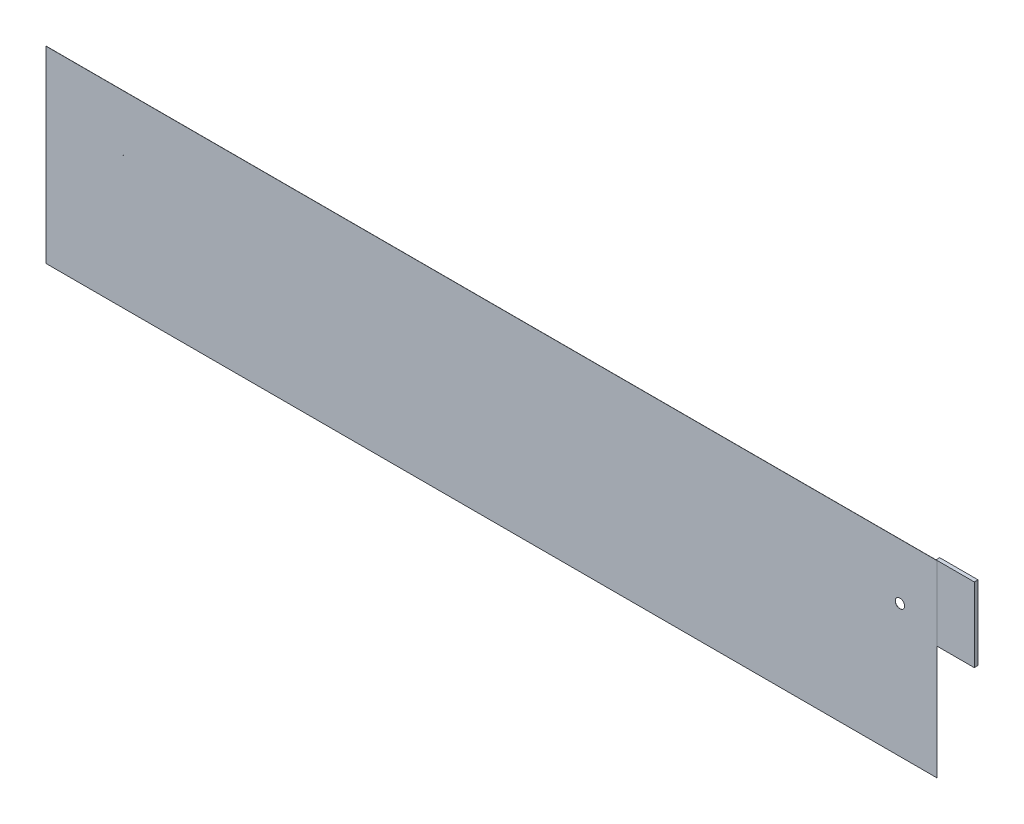
ISO-10303-21;
HEADER;
FILE_DESCRIPTION(('STEP AP214'),'2;1');
FILE_NAME('part.step','',(''),(''),'','','');
FILE_SCHEMA(('AUTOMOTIVE_DESIGN { 1 0 10303 214 1 1 1 1 }'));
ENDSEC;
DATA;
#1=APPLICATION_CONTEXT('core data for automotive mechanical design processes');
#2=APPLICATION_PROTOCOL_DEFINITION('international standard','automotive_design',2000,#1);
#3=PRODUCT_CONTEXT('',#1,'mechanical');
#4=PRODUCT('Part','Part','',(#3));
#5=PRODUCT_RELATED_PRODUCT_CATEGORY('part','',(#4));
#6=PRODUCT_DEFINITION_FORMATION('','',#4);
#7=PRODUCT_DEFINITION_CONTEXT('part definition',#1,'design');
#8=PRODUCT_DEFINITION('design','',#6,#7);
#9=PRODUCT_DEFINITION_SHAPE('','',#8);
#10=(LENGTH_UNIT() NAMED_UNIT(*) SI_UNIT(.MILLI.,.METRE.));
#11=(NAMED_UNIT(*) PLANE_ANGLE_UNIT() SI_UNIT($,.RADIAN.));
#12=(NAMED_UNIT(*) SI_UNIT($,.STERADIAN.) SOLID_ANGLE_UNIT());
#13=UNCERTAINTY_MEASURE_WITH_UNIT(LENGTH_MEASURE(1.E-05),#10,'distance_accuracy_value','');
#14=(GEOMETRIC_REPRESENTATION_CONTEXT(3) GLOBAL_UNCERTAINTY_ASSIGNED_CONTEXT((#13)) GLOBAL_UNIT_ASSIGNED_CONTEXT((#10,
#11,#12)) REPRESENTATION_CONTEXT('',''));
#15=CARTESIAN_POINT('',(0.,0.,0.));
#16=DIRECTION('',(0.,0.,1.));
#17=DIRECTION('',(1.,0.,0.));
#18=AXIS2_PLACEMENT_3D('',#15,#16,#17);
#19=CARTESIAN_POINT('',(0.,0.,0.));
#20=DIRECTION('',(0.,0.,-1.));
#21=DIRECTION('',(-1.,0.,0.));
#22=AXIS2_PLACEMENT_3D('',#19,#20,#21);
#23=PLANE('',#22);
#24=CARTESIAN_POINT('',(52.9746921364165,90.678,0.));
#25=DIRECTION('',(0.,0.,1.));
#26=DIRECTION('',(1.,0.,0.));
#27=AXIS2_PLACEMENT_3D('',#24,#25,#26);
#28=CIRCLE('',#27,0.174798991152219);
#29=CARTESIAN_POINT('',(53.1494911275687,90.678,0.));
#30=VERTEX_POINT('',#29);
#31=EDGE_CURVE('E157',#30,#30,#28,.T.);
#32=ORIENTED_EDGE('',*,*,#31,.T.);
#33=EDGE_LOOP('',(#32));
#34=FACE_BOUND('',#33,.T.);
#35=CARTESIAN_POINT('',(584.2,90.678,0.));
#36=DIRECTION('',(0.,0.,1.));
#37=DIRECTION('',(1.,0.,0.));
#38=AXIS2_PLACEMENT_3D('',#35,#36,#37);
#39=CIRCLE('',#38,3.17500000000008);
#40=CARTESIAN_POINT('',(587.375,90.678,0.));
#41=VERTEX_POINT('',#40);
#42=EDGE_CURVE('E144',#41,#41,#39,.T.);
#43=ORIENTED_EDGE('',*,*,#42,.T.);
#44=EDGE_LOOP('',(#43));
#45=FACE_BOUND('',#44,.T.);
#46=DIRECTION('',(-1.,0.,0.));
#47=VECTOR('',#46,1.);
#48=CARTESIAN_POINT('',(0.,128.778,0.));
#49=LINE('',#48,#47);
#50=CARTESIAN_POINT('',(608.80625,128.778,0.));
#51=VERTEX_POINT('',#50);
#52=CARTESIAN_POINT('',(0.,128.778,0.));
#53=VERTEX_POINT('',#52);
#54=EDGE_CURVE('E82',#51,#53,#49,.T.);
#55=ORIENTED_EDGE('',*,*,#54,.F.);
#56=DIRECTION('',(0.,-1.,0.));
#57=VECTOR('',#56,1.);
#58=CARTESIAN_POINT('',(608.80625,0.,0.));
#59=LINE('',#58,#57);
#60=CARTESIAN_POINT('',(608.80625,77.978,0.));
#61=VERTEX_POINT('',#60);
#62=EDGE_CURVE('E137',#51,#61,#59,.T.);
#63=ORIENTED_EDGE('',*,*,#62,.T.);
#64=DIRECTION('',(1.,0.,0.));
#65=VECTOR('',#64,1.);
#66=CARTESIAN_POINT('',(0.,77.978,0.));
#67=LINE('',#66,#65);
#68=CARTESIAN_POINT('',(609.6,77.978,0.));
#69=VERTEX_POINT('',#68);
#70=EDGE_CURVE('E207',#61,#69,#67,.T.);
#71=ORIENTED_EDGE('',*,*,#70,.T.);
#72=DIRECTION('',(0.,1.,0.));
#73=VECTOR('',#72,1.);
#74=CARTESIAN_POINT('',(609.6,0.,0.));
#75=LINE('',#74,#73);
#76=CARTESIAN_POINT('',(609.6,0.,0.));
#77=VERTEX_POINT('',#76);
#78=EDGE_CURVE('E185',#77,#69,#75,.T.);
#79=ORIENTED_EDGE('',*,*,#78,.F.);
#80=DIRECTION('',(1.,0.,0.));
#81=VECTOR('',#80,1.);
#82=CARTESIAN_POINT('',(0.,0.,0.));
#83=LINE('',#82,#81);
#84=CARTESIAN_POINT('',(0.,0.,0.));
#85=VERTEX_POINT('',#84);
#86=EDGE_CURVE('E181',#85,#77,#83,.T.);
#87=ORIENTED_EDGE('',*,*,#86,.F.);
#88=DIRECTION('',(0.,-1.,0.));
#89=VECTOR('',#88,1.);
#90=CARTESIAN_POINT('',(0.,0.,0.));
#91=LINE('',#90,#89);
#92=EDGE_CURVE('E163',#53,#85,#91,.T.);
#93=ORIENTED_EDGE('',*,*,#92,.F.);
#94=EDGE_LOOP('',(#55,#63,#71,#79,#87,#93));
#95=FACE_BOUND('',#94,.T.);
#96=ADVANCED_FACE('F39',(#34,#45,#95),#23,.T.);
#97=CARTESIAN_POINT('',(0.,0.,0.0999998));
#98=DIRECTION('',(0.,0.,-1.));
#99=DIRECTION('',(-1.,0.,0.));
#100=AXIS2_PLACEMENT_3D('',#97,#98,#99);
#101=PLANE('',#100);
#102=DIRECTION('',(0.,-1.,0.));
#103=VECTOR('',#102,1.);
#104=CARTESIAN_POINT('',(0.,0.,0.0999998));
#105=LINE('',#104,#103);
#106=CARTESIAN_POINT('',(0.,128.778,0.0999998));
#107=VERTEX_POINT('',#106);
#108=CARTESIAN_POINT('',(0.,0.,0.0999998));
#109=VERTEX_POINT('',#108);
#110=EDGE_CURVE('E167',#107,#109,#105,.T.);
#111=ORIENTED_EDGE('',*,*,#110,.T.);
#112=DIRECTION('',(1.,0.,0.));
#113=VECTOR('',#112,1.);
#114=CARTESIAN_POINT('',(0.,0.,0.0999998));
#115=LINE('',#114,#113);
#116=CARTESIAN_POINT('',(609.6,0.,0.0999998));
#117=VERTEX_POINT('',#116);
#118=EDGE_CURVE('E89',#109,#117,#115,.T.);
#119=ORIENTED_EDGE('',*,*,#118,.T.);
#120=DIRECTION('',(0.,1.,0.));
#121=VECTOR('',#120,1.);
#122=CARTESIAN_POINT('',(609.6,0.,0.0999998));
#123=LINE('',#122,#121);
#124=CARTESIAN_POINT('',(609.6,128.778,0.0999998));
#125=VERTEX_POINT('',#124);
#126=EDGE_CURVE('E172',#117,#125,#123,.T.);
#127=ORIENTED_EDGE('',*,*,#126,.T.);
#128=DIRECTION('',(-1.,0.,0.));
#129=VECTOR('',#128,1.);
#130=CARTESIAN_POINT('',(0.,128.778,0.0999998));
#131=LINE('',#130,#129);
#132=EDGE_CURVE('E64',#125,#107,#131,.T.);
#133=ORIENTED_EDGE('',*,*,#132,.T.);
#134=EDGE_LOOP('',(#111,#119,#127,#133));
#135=FACE_BOUND('',#134,.T.);
#136=CARTESIAN_POINT('',(52.9746921364165,90.678,0.0999998));
#137=DIRECTION('',(0.,0.,1.));
#138=DIRECTION('',(1.,0.,0.));
#139=AXIS2_PLACEMENT_3D('',#136,#137,#138);
#140=CIRCLE('',#139,0.174798991152219);
#141=CARTESIAN_POINT('',(53.1494911275687,90.678,0.0999998));
#142=VERTEX_POINT('',#141);
#143=EDGE_CURVE('E159',#142,#142,#140,.T.);
#144=ORIENTED_EDGE('',*,*,#143,.F.);
#145=EDGE_LOOP('',(#144));
#146=FACE_BOUND('',#145,.T.);
#147=CARTESIAN_POINT('',(584.2,90.678,0.0999998));
#148=DIRECTION('',(0.,0.,1.));
#149=DIRECTION('',(1.,0.,0.));
#150=AXIS2_PLACEMENT_3D('',#147,#148,#149);
#151=CIRCLE('',#150,3.17500000000008);
#152=CARTESIAN_POINT('',(587.375,90.678,0.0999998));
#153=VERTEX_POINT('',#152);
#154=EDGE_CURVE('E149',#153,#153,#151,.T.);
#155=ORIENTED_EDGE('',*,*,#154,.F.);
#156=EDGE_LOOP('',(#155));
#157=FACE_BOUND('',#156,.T.);
#158=ADVANCED_FACE('F236',(#135,#146,#157),#101,.F.);
#159=CARTESIAN_POINT('',(0.,0.,0.0999998));
#160=DIRECTION('',(1.,0.,0.));
#161=DIRECTION('',(0.,0.,-1.));
#162=AXIS2_PLACEMENT_3D('',#159,#160,#161);
#163=PLANE('',#162);
#164=ORIENTED_EDGE('',*,*,#92,.T.);
#165=DIRECTION('',(0.,0.,-1.));
#166=VECTOR('',#165,1.);
#167=CARTESIAN_POINT('',(0.,0.,0.0999998));
#168=LINE('',#167,#166);
#169=EDGE_CURVE('E11',#109,#85,#168,.T.);
#170=ORIENTED_EDGE('',*,*,#169,.F.);
#171=ORIENTED_EDGE('',*,*,#110,.F.);
#172=DIRECTION('',(0.,0.,-1.));
#173=VECTOR('',#172,1.);
#174=CARTESIAN_POINT('',(0.,128.778,0.0999998));
#175=LINE('',#174,#173);
#176=EDGE_CURVE('E177',#107,#53,#175,.T.);
#177=ORIENTED_EDGE('',*,*,#176,.T.);
#178=EDGE_LOOP('',(#164,#170,#171,#177));
#179=FACE_BOUND('',#178,.T.);
#180=ADVANCED_FACE('F41',(#179),#163,.F.);
#181=CARTESIAN_POINT('',(0.,0.,0.0999998));
#182=DIRECTION('',(0.,1.,0.));
#183=DIRECTION('',(0.,0.,1.));
#184=AXIS2_PLACEMENT_3D('',#181,#182,#183);
#185=PLANE('',#184);
#186=ORIENTED_EDGE('',*,*,#86,.T.);
#187=DIRECTION('',(0.,0.,-1.));
#188=VECTOR('',#187,1.);
#189=CARTESIAN_POINT('',(609.6,0.,0.0999998));
#190=LINE('',#189,#188);
#191=EDGE_CURVE('E48',#117,#77,#190,.T.);
#192=ORIENTED_EDGE('',*,*,#191,.F.);
#193=ORIENTED_EDGE('',*,*,#118,.F.);
#194=ORIENTED_EDGE('',*,*,#169,.T.);
#195=EDGE_LOOP('',(#186,#192,#193,#194));
#196=FACE_BOUND('',#195,.T.);
#197=ADVANCED_FACE('F261',(#196),#185,.F.);
#198=CARTESIAN_POINT('',(609.6,0.,0.0999998));
#199=DIRECTION('',(-1.,0.,0.));
#200=DIRECTION('',(0.,0.,1.));
#201=AXIS2_PLACEMENT_3D('',#198,#199,#200);
#202=PLANE('',#201);
#203=ORIENTED_EDGE('',*,*,#78,.T.);
#204=CARTESIAN_POINT('',(609.6,128.778,0.));
#205=VERTEX_POINT('',#204);
#206=EDGE_CURVE('E184',#69,#205,#75,.T.);
#207=ORIENTED_EDGE('',*,*,#206,.T.);
#208=DIRECTION('',(0.,0.,-1.));
#209=VECTOR('',#208,1.);
#210=CARTESIAN_POINT('',(609.6,128.778,0.0999998));
#211=LINE('',#210,#209);
#212=EDGE_CURVE('E193',#125,#205,#211,.T.);
#213=ORIENTED_EDGE('',*,*,#212,.F.);
#214=ORIENTED_EDGE('',*,*,#126,.F.);
#215=ORIENTED_EDGE('',*,*,#191,.T.);
#216=EDGE_LOOP('',(#203,#207,#213,#214,#215));
#217=FACE_BOUND('',#216,.T.);
#218=ADVANCED_FACE('F200',(#217),#202,.F.);
#219=CARTESIAN_POINT('',(0.,128.778,0.0999998));
#220=DIRECTION('',(0.,-1.,0.));
#221=DIRECTION('',(0.,0.,-1.));
#222=AXIS2_PLACEMENT_3D('',#219,#220,#221);
#223=PLANE('',#222);
#224=ORIENTED_EDGE('',*,*,#212,.T.);
#225=DIRECTION('',(1.,0.,0.));
#226=VECTOR('',#225,1.);
#227=CARTESIAN_POINT('',(0.,128.778,0.));
#228=LINE('',#227,#226);
#229=CARTESIAN_POINT('',(635.,128.778,0.));
#230=VERTEX_POINT('',#229);
#231=EDGE_CURVE('E141',#205,#230,#228,.T.);
#232=ORIENTED_EDGE('',*,*,#231,.T.);
#233=DIRECTION('',(0.,0.,1.));
#234=VECTOR('',#233,1.);
#235=CARTESIAN_POINT('',(635.,128.778,-2.54));
#236=LINE('',#235,#234);
#237=CARTESIAN_POINT('',(635.,128.778,-2.54));
#238=VERTEX_POINT('',#237);
#239=EDGE_CURVE('E122',#238,#230,#236,.T.);
#240=ORIENTED_EDGE('',*,*,#239,.F.);
#241=DIRECTION('',(1.,0.,0.));
#242=VECTOR('',#241,1.);
#243=CARTESIAN_POINT('',(0.,128.778,-2.54));
#244=LINE('',#243,#242);
#245=CARTESIAN_POINT('',(608.80625,128.778,-2.54));
#246=VERTEX_POINT('',#245);
#247=EDGE_CURVE('E129',#246,#238,#244,.T.);
#248=ORIENTED_EDGE('',*,*,#247,.F.);
#249=DIRECTION('',(0.,0.,1.));
#250=VECTOR('',#249,1.);
#251=CARTESIAN_POINT('',(608.80625,128.778,-2.54));
#252=LINE('',#251,#250);
#253=EDGE_CURVE('E218',#246,#51,#252,.T.);
#254=ORIENTED_EDGE('',*,*,#253,.T.);
#255=ORIENTED_EDGE('',*,*,#54,.T.);
#256=ORIENTED_EDGE('',*,*,#176,.F.);
#257=ORIENTED_EDGE('',*,*,#132,.F.);
#258=EDGE_LOOP('',(#224,#232,#240,#248,#254,#255,#256,#257));
#259=FACE_BOUND('',#258,.T.);
#260=ADVANCED_FACE('F140',(#259),#223,.F.);
#261=CARTESIAN_POINT('',(52.9746921364165,90.678,0.0999998));
#262=DIRECTION('',(0.,0.,-1.));
#263=DIRECTION('',(-1.,0.,0.));
#264=AXIS2_PLACEMENT_3D('',#261,#262,#263);
#265=CYLINDRICAL_SURFACE('',#264,0.174798991152219);
#266=ORIENTED_EDGE('',*,*,#143,.T.);
#267=EDGE_LOOP('',(#266));
#268=FACE_BOUND('',#267,.T.);
#269=ORIENTED_EDGE('',*,*,#31,.F.);
#270=EDGE_LOOP('',(#269));
#271=FACE_BOUND('',#270,.T.);
#272=ADVANCED_FACE('F247',(#268,#271),#265,.F.);
#273=CARTESIAN_POINT('',(584.2,90.678,0.0999998));
#274=DIRECTION('',(0.,0.,-1.));
#275=DIRECTION('',(-1.,0.,0.));
#276=AXIS2_PLACEMENT_3D('',#273,#274,#275);
#277=CYLINDRICAL_SURFACE('',#276,3.17500000000008);
#278=ORIENTED_EDGE('',*,*,#154,.T.);
#279=EDGE_LOOP('',(#278));
#280=FACE_BOUND('',#279,.T.);
#281=ORIENTED_EDGE('',*,*,#42,.F.);
#282=EDGE_LOOP('',(#281));
#283=FACE_BOUND('',#282,.T.);
#284=ADVANCED_FACE('F244',(#280,#283),#277,.F.);
#285=CARTESIAN_POINT('',(635.,0.,-2.54));
#286=DIRECTION('',(-1.,0.,0.));
#287=DIRECTION('',(0.,0.,1.));
#288=AXIS2_PLACEMENT_3D('',#285,#286,#287);
#289=PLANE('',#288);
#290=DIRECTION('',(0.,-1.,0.));
#291=VECTOR('',#290,1.);
#292=CARTESIAN_POINT('',(635.,0.,0.));
#293=LINE('',#292,#291);
#294=CARTESIAN_POINT('',(635.,77.978,0.));
#295=VERTEX_POINT('',#294);
#296=EDGE_CURVE('E214',#230,#295,#293,.T.);
#297=ORIENTED_EDGE('',*,*,#296,.T.);
#298=DIRECTION('',(0.,0.,1.));
#299=VECTOR('',#298,1.);
#300=CARTESIAN_POINT('',(635.,77.978,-2.54));
#301=LINE('',#300,#299);
#302=CARTESIAN_POINT('',(635.,77.978,-2.54));
#303=VERTEX_POINT('',#302);
#304=EDGE_CURVE('E123',#303,#295,#301,.T.);
#305=ORIENTED_EDGE('',*,*,#304,.F.);
#306=DIRECTION('',(0.,-1.,0.));
#307=VECTOR('',#306,1.);
#308=CARTESIAN_POINT('',(635.,0.,-2.54));
#309=LINE('',#308,#307);
#310=EDGE_CURVE('E117',#238,#303,#309,.T.);
#311=ORIENTED_EDGE('',*,*,#310,.F.);
#312=ORIENTED_EDGE('',*,*,#239,.T.);
#313=EDGE_LOOP('',(#297,#305,#311,#312));
#314=FACE_BOUND('',#313,.T.);
#315=ADVANCED_FACE('F120',(#314),#289,.F.);
#316=CARTESIAN_POINT('',(0.,77.978,-2.54));
#317=DIRECTION('',(0.,-1.,0.));
#318=DIRECTION('',(0.,0.,-1.));
#319=AXIS2_PLACEMENT_3D('',#316,#317,#318);
#320=PLANE('',#319);
#321=ORIENTED_EDGE('',*,*,#70,.F.);
#322=DIRECTION('',(0.,0.,1.));
#323=VECTOR('',#322,1.);
#324=CARTESIAN_POINT('',(608.80625,77.978,-2.54));
#325=LINE('',#324,#323);
#326=CARTESIAN_POINT('',(608.80625,77.978,-2.54));
#327=VERTEX_POINT('',#326);
#328=EDGE_CURVE('E151',#327,#61,#325,.T.);
#329=ORIENTED_EDGE('',*,*,#328,.F.);
#330=DIRECTION('',(1.,0.,0.));
#331=VECTOR('',#330,1.);
#332=CARTESIAN_POINT('',(0.,77.978,-2.54));
#333=LINE('',#332,#331);
#334=EDGE_CURVE('E128',#327,#303,#333,.T.);
#335=ORIENTED_EDGE('',*,*,#334,.T.);
#336=ORIENTED_EDGE('',*,*,#304,.T.);
#337=EDGE_CURVE('E55',#69,#295,#67,.T.);
#338=ORIENTED_EDGE('',*,*,#337,.F.);
#339=EDGE_LOOP('',(#321,#329,#335,#336,#338));
#340=FACE_BOUND('',#339,.T.);
#341=ADVANCED_FACE('F223',(#340),#320,.T.);
#342=CARTESIAN_POINT('',(608.80625,0.,-2.54));
#343=DIRECTION('',(-1.,0.,0.));
#344=DIRECTION('',(0.,0.,1.));
#345=AXIS2_PLACEMENT_3D('',#342,#343,#344);
#346=PLANE('',#345);
#347=ORIENTED_EDGE('',*,*,#62,.F.);
#348=ORIENTED_EDGE('',*,*,#253,.F.);
#349=DIRECTION('',(0.,-1.,0.));
#350=VECTOR('',#349,1.);
#351=CARTESIAN_POINT('',(608.80625,0.,-2.54));
#352=LINE('',#351,#350);
#353=EDGE_CURVE('E135',#246,#327,#352,.T.);
#354=ORIENTED_EDGE('',*,*,#353,.T.);
#355=ORIENTED_EDGE('',*,*,#328,.T.);
#356=EDGE_LOOP('',(#347,#348,#354,#355));
#357=FACE_BOUND('',#356,.T.);
#358=ADVANCED_FACE('F222',(#357),#346,.T.);
#359=CARTESIAN_POINT('',(0.,0.,-2.54));
#360=DIRECTION('',(0.,0.,-1.));
#361=DIRECTION('',(-1.,0.,0.));
#362=AXIS2_PLACEMENT_3D('',#359,#360,#361);
#363=PLANE('',#362);
#364=ORIENTED_EDGE('',*,*,#247,.T.);
#365=ORIENTED_EDGE('',*,*,#310,.T.);
#366=ORIENTED_EDGE('',*,*,#334,.F.);
#367=ORIENTED_EDGE('',*,*,#353,.F.);
#368=EDGE_LOOP('',(#364,#365,#366,#367));
#369=FACE_BOUND('',#368,.T.);
#370=ADVANCED_FACE('F133',(#369),#363,.T.);
#371=CARTESIAN_POINT('',(0.,0.,0.));
#372=DIRECTION('',(0.,0.,-1.));
#373=DIRECTION('',(-1.,0.,0.));
#374=AXIS2_PLACEMENT_3D('',#371,#372,#373);
#375=PLANE('',#374);
#376=ORIENTED_EDGE('',*,*,#206,.F.);
#377=ORIENTED_EDGE('',*,*,#337,.T.);
#378=ORIENTED_EDGE('',*,*,#296,.F.);
#379=ORIENTED_EDGE('',*,*,#231,.F.);
#380=EDGE_LOOP('',(#376,#377,#378,#379));
#381=FACE_BOUND('',#380,.T.);
#382=ADVANCED_FACE('F231',(#381),#375,.F.);
#383=CLOSED_SHELL('',(#96,#158,#180,#197,#218,#260,#272,#284,#315,#341,#358,#370,#382));
#384=MANIFOLD_SOLID_BREP('B2',#383);
#385=ADVANCED_BREP_SHAPE_REPRESENTATION('',(#18,#384),#14);
#386=SHAPE_DEFINITION_REPRESENTATION(#9,#385);
ENDSEC;
END-ISO-10303-21;
